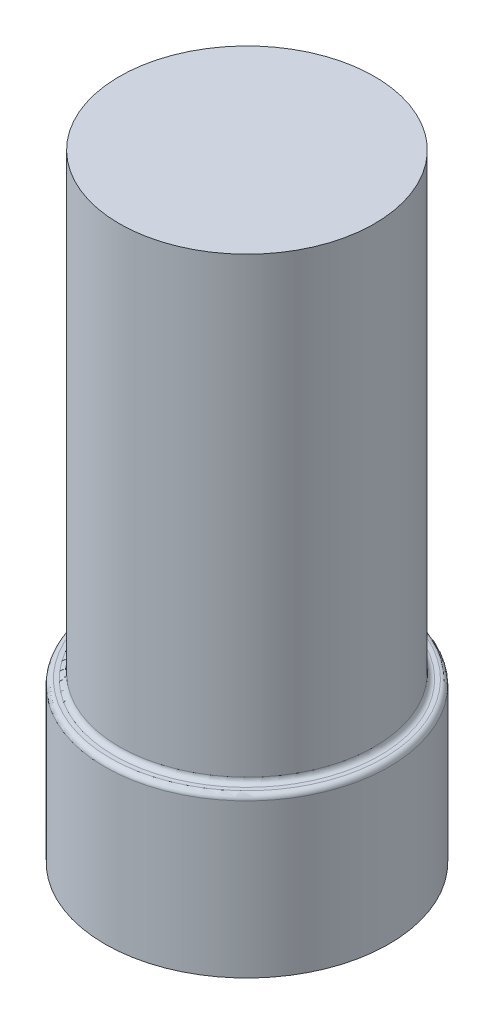
ISO-10303-21;
HEADER;
FILE_DESCRIPTION(('STEP AP214'),'2;1');
FILE_NAME('part.step','',(''),(''),'','','');
FILE_SCHEMA(('AUTOMOTIVE_DESIGN { 1 0 10303 214 1 1 1 1 }'));
ENDSEC;
DATA;
#1=APPLICATION_CONTEXT('core data for automotive mechanical design processes');
#2=APPLICATION_PROTOCOL_DEFINITION('international standard','automotive_design',2000,#1);
#3=PRODUCT_CONTEXT('',#1,'mechanical');
#4=PRODUCT('Part','Part','',(#3));
#5=PRODUCT_RELATED_PRODUCT_CATEGORY('part','',(#4));
#6=PRODUCT_DEFINITION_FORMATION('','',#4);
#7=PRODUCT_DEFINITION_CONTEXT('part definition',#1,'design');
#8=PRODUCT_DEFINITION('design','',#6,#7);
#9=PRODUCT_DEFINITION_SHAPE('','',#8);
#10=(LENGTH_UNIT() NAMED_UNIT(*) SI_UNIT(.MILLI.,.METRE.));
#11=(NAMED_UNIT(*) PLANE_ANGLE_UNIT() SI_UNIT($,.RADIAN.));
#12=(NAMED_UNIT(*) SI_UNIT($,.STERADIAN.) SOLID_ANGLE_UNIT());
#13=UNCERTAINTY_MEASURE_WITH_UNIT(LENGTH_MEASURE(1.E-05),#10,'distance_accuracy_value','');
#14=(GEOMETRIC_REPRESENTATION_CONTEXT(3) GLOBAL_UNCERTAINTY_ASSIGNED_CONTEXT((#13)) GLOBAL_UNIT_ASSIGNED_CONTEXT((#10,
#11,#12)) REPRESENTATION_CONTEXT('',''));
#15=CARTESIAN_POINT('',(0.,0.,0.));
#16=DIRECTION('',(0.,0.,1.));
#17=DIRECTION('',(1.,0.,0.));
#18=AXIS2_PLACEMENT_3D('',#15,#16,#17);
#19=CARTESIAN_POINT('',(0.,15.35,0.));
#20=DIRECTION('',(0.,-1.,0.));
#21=DIRECTION('',(0.,0.,-1.));
#22=AXIS2_PLACEMENT_3D('',#19,#20,#21);
#23=CYLINDRICAL_SURFACE('',#22,13.75);
#24=CARTESIAN_POINT('',(0.,14.85,0.));
#25=DIRECTION('',(0.,1.,0.));
#26=DIRECTION('',(0.,0.,1.));
#27=AXIS2_PLACEMENT_3D('',#24,#25,#26);
#28=CIRCLE('',#27,13.75);
#29=CARTESIAN_POINT('',(0.,14.85,13.75));
#30=VERTEX_POINT('',#29);
#31=EDGE_CURVE('E47',#30,#30,#28,.F.);
#32=ORIENTED_EDGE('',*,*,#31,.T.);
#33=EDGE_LOOP('',(#32));
#34=FACE_BOUND('',#33,.T.);
#35=CARTESIAN_POINT('',(0.,0.,0.));
#36=DIRECTION('',(0.,1.,0.));
#37=DIRECTION('',(0.,0.,1.));
#38=AXIS2_PLACEMENT_3D('',#35,#36,#37);
#39=CIRCLE('',#38,13.75);
#40=CARTESIAN_POINT('',(0.,0.,13.75));
#41=VERTEX_POINT('',#40);
#42=EDGE_CURVE('E99',#41,#41,#39,.T.);
#43=ORIENTED_EDGE('',*,*,#42,.T.);
#44=EDGE_LOOP('',(#43));
#45=FACE_BOUND('',#44,.T.);
#46=ADVANCED_FACE('F39',(#34,#45),#23,.T.);
#47=CARTESIAN_POINT('',(0.,15.35,0.));
#48=DIRECTION('',(0.,1.,0.));
#49=DIRECTION('',(0.,0.,1.));
#50=AXIS2_PLACEMENT_3D('',#47,#48,#49);
#51=PLANE('',#50);
#52=CARTESIAN_POINT('',(0.,15.35,0.));
#53=DIRECTION('',(0.,1.,0.));
#54=DIRECTION('',(0.,0.,1.));
#55=AXIS2_PLACEMENT_3D('',#52,#53,#54);
#56=CIRCLE('',#55,12.85);
#57=CARTESIAN_POINT('',(0.,15.35,12.85));
#58=VERTEX_POINT('',#57);
#59=EDGE_CURVE('E93',#58,#58,#56,.F.);
#60=ORIENTED_EDGE('',*,*,#59,.T.);
#61=EDGE_LOOP('',(#60));
#62=FACE_BOUND('',#61,.T.);
#63=CARTESIAN_POINT('',(0.,15.35,0.));
#64=DIRECTION('',(0.,1.,0.));
#65=DIRECTION('',(0.,0.,1.));
#66=AXIS2_PLACEMENT_3D('',#63,#64,#65);
#67=CIRCLE('',#66,13.25);
#68=CARTESIAN_POINT('',(0.,15.35,13.25));
#69=VERTEX_POINT('',#68);
#70=EDGE_CURVE('E91',#69,#69,#67,.T.);
#71=ORIENTED_EDGE('',*,*,#70,.T.);
#72=EDGE_LOOP('',(#71));
#73=FACE_BOUND('',#72,.T.);
#74=ADVANCED_FACE('F61',(#62,#73),#51,.T.);
#75=CARTESIAN_POINT('',(0.,0.,0.));
#76=DIRECTION('',(0.,1.,0.));
#77=DIRECTION('',(0.,0.,1.));
#78=AXIS2_PLACEMENT_3D('',#75,#76,#77);
#79=PLANE('',#78);
#80=CARTESIAN_POINT('',(0.,0.,0.));
#81=DIRECTION('',(0.,-1.,0.));
#82=DIRECTION('',(0.,0.,-1.));
#83=AXIS2_PLACEMENT_3D('',#80,#81,#82);
#84=CIRCLE('',#83,2.8);
#85=CARTESIAN_POINT('',(0.,0.,-2.8));
#86=VERTEX_POINT('',#85);
#87=EDGE_CURVE('E108',#86,#86,#84,.T.);
#88=ORIENTED_EDGE('',*,*,#87,.F.);
#89=EDGE_LOOP('',(#88));
#90=FACE_BOUND('',#89,.T.);
#91=ORIENTED_EDGE('',*,*,#42,.F.);
#92=EDGE_LOOP('',(#91));
#93=FACE_BOUND('',#92,.T.);
#94=ADVANCED_FACE('F67',(#90,#93),#79,.F.);
#95=CARTESIAN_POINT('',(0.,154.331074990615,0.));
#96=DIRECTION('',(0.,-1.,0.));
#97=DIRECTION('',(0.,0.,-1.));
#98=AXIS2_PLACEMENT_3D('',#95,#96,#97);
#99=CYLINDRICAL_SURFACE('',#98,12.35);
#100=CARTESIAN_POINT('',(0.,15.85,0.));
#101=DIRECTION('',(0.,1.,0.));
#102=DIRECTION('',(0.,0.,1.));
#103=AXIS2_PLACEMENT_3D('',#100,#101,#102);
#104=CIRCLE('',#103,12.35);
#105=CARTESIAN_POINT('',(0.,15.85,12.35));
#106=VERTEX_POINT('',#105);
#107=EDGE_CURVE('E94',#106,#106,#104,.T.);
#108=ORIENTED_EDGE('',*,*,#107,.T.);
#109=EDGE_LOOP('',(#108));
#110=FACE_BOUND('',#109,.T.);
#111=CARTESIAN_POINT('',(0.,59.7,0.));
#112=DIRECTION('',(0.,1.,0.));
#113=DIRECTION('',(0.,0.,1.));
#114=AXIS2_PLACEMENT_3D('',#111,#112,#113);
#115=CIRCLE('',#114,12.35);
#116=CARTESIAN_POINT('',(0.,59.7,12.35));
#117=VERTEX_POINT('',#116);
#118=EDGE_CURVE('E104',#117,#117,#115,.T.);
#119=ORIENTED_EDGE('',*,*,#118,.F.);
#120=EDGE_LOOP('',(#119));
#121=FACE_BOUND('',#120,.T.);
#122=ADVANCED_FACE('F127',(#110,#121),#99,.T.);
#123=CARTESIAN_POINT('',(0.,59.7,0.));
#124=DIRECTION('',(0.,1.,0.));
#125=DIRECTION('',(0.,0.,1.));
#126=AXIS2_PLACEMENT_3D('',#123,#124,#125);
#127=PLANE('',#126);
#128=ORIENTED_EDGE('',*,*,#118,.T.);
#129=EDGE_LOOP('',(#128));
#130=FACE_BOUND('',#129,.T.);
#131=ADVANCED_FACE('F77',(#130),#127,.T.);
#132=CARTESIAN_POINT('',(0.,15.85,0.));
#133=DIRECTION('',(0.,1.,0.));
#134=DIRECTION('',(0.,0.,1.));
#135=AXIS2_PLACEMENT_3D('',#132,#133,#134);
#136=TOROIDAL_SURFACE('',#135,12.85,0.5);
#137=ORIENTED_EDGE('',*,*,#59,.F.);
#138=EDGE_LOOP('',(#137));
#139=FACE_BOUND('',#138,.T.);
#140=ORIENTED_EDGE('',*,*,#107,.F.);
#141=EDGE_LOOP('',(#140));
#142=FACE_BOUND('',#141,.T.);
#143=ADVANCED_FACE('F74',(#139,#142),#136,.F.);
#144=CARTESIAN_POINT('',(0.,14.85,0.));
#145=DIRECTION('',(0.,1.,0.));
#146=DIRECTION('',(0.,0.,1.));
#147=AXIS2_PLACEMENT_3D('',#144,#145,#146);
#148=TOROIDAL_SURFACE('',#147,13.25,0.5);
#149=ORIENTED_EDGE('',*,*,#31,.F.);
#150=EDGE_LOOP('',(#149));
#151=FACE_BOUND('',#150,.T.);
#152=ORIENTED_EDGE('',*,*,#70,.F.);
#153=EDGE_LOOP('',(#152));
#154=FACE_BOUND('',#153,.T.);
#155=ADVANCED_FACE('F76',(#151,#154),#148,.T.);
#156=CARTESIAN_POINT('',(0.,3.,0.));
#157=DIRECTION('',(0.,-1.,0.));
#158=DIRECTION('',(0.,0.,-1.));
#159=AXIS2_PLACEMENT_3D('',#156,#157,#158);
#160=CYLINDRICAL_SURFACE('',#159,2.8);
#161=CARTESIAN_POINT('',(0.,3.,0.));
#162=DIRECTION('',(0.,-1.,0.));
#163=DIRECTION('',(0.,0.,-1.));
#164=AXIS2_PLACEMENT_3D('',#161,#162,#163);
#165=CIRCLE('',#164,2.8);
#166=CARTESIAN_POINT('',(0.,3.,-2.8));
#167=VERTEX_POINT('',#166);
#168=EDGE_CURVE('E107',#167,#167,#165,.T.);
#169=ORIENTED_EDGE('',*,*,#168,.F.);
#170=EDGE_LOOP('',(#169));
#171=FACE_BOUND('',#170,.T.);
#172=ORIENTED_EDGE('',*,*,#87,.T.);
#173=EDGE_LOOP('',(#172));
#174=FACE_BOUND('',#173,.T.);
#175=ADVANCED_FACE('F80',(#171,#174),#160,.F.);
#176=CARTESIAN_POINT('',(0.,3.,0.));
#177=DIRECTION('',(0.,-1.,0.));
#178=DIRECTION('',(0.,0.,-1.));
#179=AXIS2_PLACEMENT_3D('',#176,#177,#178);
#180=PLANE('',#179);
#181=CARTESIAN_POINT('',(0.,3.,0.));
#182=DIRECTION('',(0.,-1.,0.));
#183=DIRECTION('',(0.,0.,-1.));
#184=AXIS2_PLACEMENT_3D('',#181,#182,#183);
#185=CIRCLE('',#184,0.5);
#186=CARTESIAN_POINT('',(0.,3.,-0.5));
#187=VERTEX_POINT('',#186);
#188=EDGE_CURVE('E111',#187,#187,#185,.T.);
#189=ORIENTED_EDGE('',*,*,#188,.F.);
#190=EDGE_LOOP('',(#189));
#191=FACE_BOUND('',#190,.T.);
#192=ORIENTED_EDGE('',*,*,#168,.T.);
#193=EDGE_LOOP('',(#192));
#194=FACE_BOUND('',#193,.T.);
#195=ADVANCED_FACE('F56',(#191,#194),#180,.T.);
#196=CARTESIAN_POINT('',(0.,0.5,0.));
#197=DIRECTION('',(0.,1.,0.));
#198=DIRECTION('',(0.,0.,1.));
#199=AXIS2_PLACEMENT_3D('',#196,#197,#198);
#200=CYLINDRICAL_SURFACE('',#199,0.5);
#201=CARTESIAN_POINT('',(0.,1.,0.));
#202=DIRECTION('',(0.,-1.,0.));
#203=DIRECTION('',(0.,0.,-1.));
#204=AXIS2_PLACEMENT_3D('',#201,#202,#203);
#205=CIRCLE('',#204,0.5);
#206=CARTESIAN_POINT('',(0.,1.,-0.5));
#207=VERTEX_POINT('',#206);
#208=EDGE_CURVE('E12',#207,#207,#205,.F.);
#209=ORIENTED_EDGE('',*,*,#208,.T.);
#210=EDGE_LOOP('',(#209));
#211=FACE_BOUND('',#210,.T.);
#212=ORIENTED_EDGE('',*,*,#188,.T.);
#213=EDGE_LOOP('',(#212));
#214=FACE_BOUND('',#213,.T.);
#215=ADVANCED_FACE('F51',(#211,#214),#200,.T.);
#216=CARTESIAN_POINT('',(0.,1.,0.));
#217=DIRECTION('',(0.,1.,0.));
#218=DIRECTION('',(0.,0.,1.));
#219=AXIS2_PLACEMENT_3D('',#216,#217,#218);
#220=CONICAL_SURFACE('',#219,0.5,0.785398163397447);
#221=ORIENTED_EDGE('',*,*,#208,.F.);
#222=EDGE_LOOP('',(#221));
#223=FACE_BOUND('',#222,.T.);
#224=CARTESIAN_POINT('',(0.,0.5,0.));
#225=VERTEX_POINT('',#224);
#226=VERTEX_LOOP('',#225);
#227=FACE_BOUND('',#226,.T.);
#228=ADVANCED_FACE('F42',(#223,#227),#220,.T.);
#229=CLOSED_SHELL('',(#46,#74,#94,#122,#131,#143,#155,#175,#195,#215,#228));
#230=MANIFOLD_SOLID_BREP('B2',#229);
#231=ADVANCED_BREP_SHAPE_REPRESENTATION('',(#18,#230),#14);
#232=SHAPE_DEFINITION_REPRESENTATION(#9,#231);
ENDSEC;
END-ISO-10303-21;
